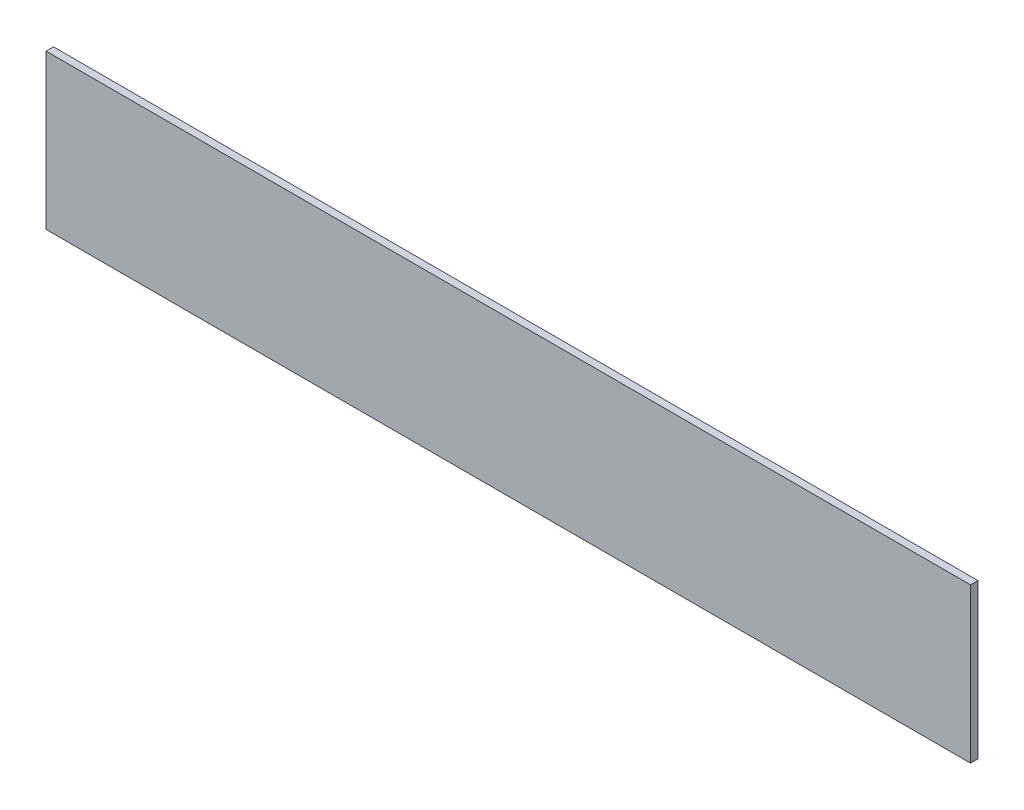
ISO-10303-21;
HEADER;
FILE_DESCRIPTION(('STEP AP214'),'2;1');
FILE_NAME('part.step','',(''),(''),'','','');
FILE_SCHEMA(('AUTOMOTIVE_DESIGN { 1 0 10303 214 1 1 1 1 }'));
ENDSEC;
DATA;
#1=APPLICATION_CONTEXT('core data for automotive mechanical design processes');
#2=APPLICATION_PROTOCOL_DEFINITION('international standard','automotive_design',2000,#1);
#3=PRODUCT_CONTEXT('',#1,'mechanical');
#4=PRODUCT('Part','Part','',(#3));
#5=PRODUCT_RELATED_PRODUCT_CATEGORY('part','',(#4));
#6=PRODUCT_DEFINITION_FORMATION('','',#4);
#7=PRODUCT_DEFINITION_CONTEXT('part definition',#1,'design');
#8=PRODUCT_DEFINITION('design','',#6,#7);
#9=PRODUCT_DEFINITION_SHAPE('','',#8);
#10=(LENGTH_UNIT() NAMED_UNIT(*) SI_UNIT(.MILLI.,.METRE.));
#11=(NAMED_UNIT(*) PLANE_ANGLE_UNIT() SI_UNIT($,.RADIAN.));
#12=(NAMED_UNIT(*) SI_UNIT($,.STERADIAN.) SOLID_ANGLE_UNIT());
#13=UNCERTAINTY_MEASURE_WITH_UNIT(LENGTH_MEASURE(1.E-05),#10,'distance_accuracy_value','');
#14=(GEOMETRIC_REPRESENTATION_CONTEXT(3) GLOBAL_UNCERTAINTY_ASSIGNED_CONTEXT((#13)) GLOBAL_UNIT_ASSIGNED_CONTEXT((#10,
#11,#12)) REPRESENTATION_CONTEXT('',''));
#15=CARTESIAN_POINT('',(0.,0.,0.));
#16=DIRECTION('',(0.,0.,1.));
#17=DIRECTION('',(1.,0.,0.));
#18=AXIS2_PLACEMENT_3D('',#15,#16,#17);
#19=CARTESIAN_POINT('',(0.,0.,3.048));
#20=DIRECTION('',(1.,0.,0.));
#21=DIRECTION('',(0.,0.,-1.));
#22=AXIS2_PLACEMENT_3D('',#19,#20,#21);
#23=PLANE('',#22);
#24=DIRECTION('',(0.,-1.,0.));
#25=VECTOR('',#24,1.);
#26=CARTESIAN_POINT('',(0.,0.,0.));
#27=LINE('',#26,#25);
#28=CARTESIAN_POINT('',(0.,63.5,0.));
#29=VERTEX_POINT('',#28);
#30=CARTESIAN_POINT('',(0.,0.,0.));
#31=VERTEX_POINT('',#30);
#32=EDGE_CURVE('E95',#29,#31,#27,.T.);
#33=ORIENTED_EDGE('',*,*,#32,.T.);
#34=DIRECTION('',(0.,0.,-1.));
#35=VECTOR('',#34,1.);
#36=CARTESIAN_POINT('',(0.,0.,3.048));
#37=LINE('',#36,#35);
#38=CARTESIAN_POINT('',(0.,0.,3.048));
#39=VERTEX_POINT('',#38);
#40=EDGE_CURVE('E11',#39,#31,#37,.T.);
#41=ORIENTED_EDGE('',*,*,#40,.F.);
#42=DIRECTION('',(0.,-1.,0.));
#43=VECTOR('',#42,1.);
#44=CARTESIAN_POINT('',(0.,0.,3.048));
#45=LINE('',#44,#43);
#46=CARTESIAN_POINT('',(0.,63.5,3.048));
#47=VERTEX_POINT('',#46);
#48=EDGE_CURVE('E83',#47,#39,#45,.T.);
#49=ORIENTED_EDGE('',*,*,#48,.F.);
#50=DIRECTION('',(0.,0.,-1.));
#51=VECTOR('',#50,1.);
#52=CARTESIAN_POINT('',(0.,63.5,3.048));
#53=LINE('',#52,#51);
#54=EDGE_CURVE('E91',#47,#29,#53,.T.);
#55=ORIENTED_EDGE('',*,*,#54,.T.);
#56=EDGE_LOOP('',(#33,#41,#49,#55));
#57=FACE_BOUND('',#56,.T.);
#58=ADVANCED_FACE('F32',(#57),#23,.F.);
#59=CARTESIAN_POINT('',(0.,0.,3.048));
#60=DIRECTION('',(0.,1.,0.));
#61=DIRECTION('',(-1.,0.,0.));
#62=AXIS2_PLACEMENT_3D('',#59,#60,#61);
#63=PLANE('',#62);
#64=DIRECTION('',(1.,0.,0.));
#65=VECTOR('',#64,1.);
#66=CARTESIAN_POINT('',(0.,0.,0.));
#67=LINE('',#66,#65);
#68=CARTESIAN_POINT('',(380.1872,0.,0.));
#69=VERTEX_POINT('',#68);
#70=EDGE_CURVE('E87',#31,#69,#67,.T.);
#71=ORIENTED_EDGE('',*,*,#70,.T.);
#72=DIRECTION('',(0.,0.,-1.));
#73=VECTOR('',#72,1.);
#74=CARTESIAN_POINT('',(380.1872,0.,3.048));
#75=LINE('',#74,#73);
#76=CARTESIAN_POINT('',(380.1872,0.,3.048));
#77=VERTEX_POINT('',#76);
#78=EDGE_CURVE('E40',#77,#69,#75,.T.);
#79=ORIENTED_EDGE('',*,*,#78,.F.);
#80=DIRECTION('',(1.,0.,0.));
#81=VECTOR('',#80,1.);
#82=CARTESIAN_POINT('',(0.,0.,3.048));
#83=LINE('',#82,#81);
#84=EDGE_CURVE('E78',#39,#77,#83,.T.);
#85=ORIENTED_EDGE('',*,*,#84,.F.);
#86=ORIENTED_EDGE('',*,*,#40,.T.);
#87=EDGE_LOOP('',(#71,#79,#85,#86));
#88=FACE_BOUND('',#87,.T.);
#89=ADVANCED_FACE('F86',(#88),#63,.F.);
#90=CARTESIAN_POINT('',(380.1872,0.,3.048));
#91=DIRECTION('',(-1.,0.,0.));
#92=DIRECTION('',(0.,0.,1.));
#93=AXIS2_PLACEMENT_3D('',#90,#91,#92);
#94=PLANE('',#93);
#95=DIRECTION('',(0.,1.,0.));
#96=VECTOR('',#95,1.);
#97=CARTESIAN_POINT('',(380.1872,0.,0.));
#98=LINE('',#97,#96);
#99=CARTESIAN_POINT('',(380.1872,63.5,0.));
#100=VERTEX_POINT('',#99);
#101=EDGE_CURVE('E65',#69,#100,#98,.T.);
#102=ORIENTED_EDGE('',*,*,#101,.T.);
#103=DIRECTION('',(0.,0.,-1.));
#104=VECTOR('',#103,1.);
#105=CARTESIAN_POINT('',(380.1872,63.5,3.048));
#106=LINE('',#105,#104);
#107=CARTESIAN_POINT('',(380.1872,63.5,3.048));
#108=VERTEX_POINT('',#107);
#109=EDGE_CURVE('E88',#108,#100,#106,.T.);
#110=ORIENTED_EDGE('',*,*,#109,.F.);
#111=DIRECTION('',(0.,1.,0.));
#112=VECTOR('',#111,1.);
#113=CARTESIAN_POINT('',(380.1872,0.,3.048));
#114=LINE('',#113,#112);
#115=EDGE_CURVE('E81',#77,#108,#114,.T.);
#116=ORIENTED_EDGE('',*,*,#115,.F.);
#117=ORIENTED_EDGE('',*,*,#78,.T.);
#118=EDGE_LOOP('',(#102,#110,#116,#117));
#119=FACE_BOUND('',#118,.T.);
#120=ADVANCED_FACE('F89',(#119),#94,.F.);
#121=CARTESIAN_POINT('',(0.,63.5,3.048));
#122=DIRECTION('',(0.,-1.,0.));
#123=DIRECTION('',(1.,0.,0.));
#124=AXIS2_PLACEMENT_3D('',#121,#122,#123);
#125=PLANE('',#124);
#126=DIRECTION('',(-1.,0.,0.));
#127=VECTOR('',#126,1.);
#128=CARTESIAN_POINT('',(0.,63.5,0.));
#129=LINE('',#128,#127);
#130=EDGE_CURVE('E71',#100,#29,#129,.T.);
#131=ORIENTED_EDGE('',*,*,#130,.T.);
#132=ORIENTED_EDGE('',*,*,#54,.F.);
#133=DIRECTION('',(-1.,0.,0.));
#134=VECTOR('',#133,1.);
#135=CARTESIAN_POINT('',(0.,63.5,3.048));
#136=LINE('',#135,#134);
#137=EDGE_CURVE('E48',#108,#47,#136,.T.);
#138=ORIENTED_EDGE('',*,*,#137,.F.);
#139=ORIENTED_EDGE('',*,*,#109,.T.);
#140=EDGE_LOOP('',(#131,#132,#138,#139));
#141=FACE_BOUND('',#140,.T.);
#142=ADVANCED_FACE('F102',(#141),#125,.F.);
#143=CARTESIAN_POINT('',(0.,0.,3.048));
#144=DIRECTION('',(0.,0.,-1.));
#145=DIRECTION('',(-1.,0.,0.));
#146=AXIS2_PLACEMENT_3D('',#143,#144,#145);
#147=PLANE('',#146);
#148=ORIENTED_EDGE('',*,*,#48,.T.);
#149=ORIENTED_EDGE('',*,*,#84,.T.);
#150=ORIENTED_EDGE('',*,*,#115,.T.);
#151=ORIENTED_EDGE('',*,*,#137,.T.);
#152=EDGE_LOOP('',(#148,#149,#150,#151));
#153=FACE_BOUND('',#152,.T.);
#154=ADVANCED_FACE('F79',(#153),#147,.F.);
#155=CARTESIAN_POINT('',(0.,0.,0.));
#156=DIRECTION('',(0.,0.,-1.));
#157=DIRECTION('',(-1.,0.,0.));
#158=AXIS2_PLACEMENT_3D('',#155,#156,#157);
#159=PLANE('',#158);
#160=ORIENTED_EDGE('',*,*,#32,.F.);
#161=ORIENTED_EDGE('',*,*,#130,.F.);
#162=ORIENTED_EDGE('',*,*,#101,.F.);
#163=ORIENTED_EDGE('',*,*,#70,.F.);
#164=EDGE_LOOP('',(#160,#161,#162,#163));
#165=FACE_BOUND('',#164,.T.);
#166=ADVANCED_FACE('F105',(#165),#159,.T.);
#167=CLOSED_SHELL('',(#58,#89,#120,#142,#154,#166));
#168=MANIFOLD_SOLID_BREP('B2',#167);
#169=ADVANCED_BREP_SHAPE_REPRESENTATION('',(#18,#168),#14);
#170=SHAPE_DEFINITION_REPRESENTATION(#9,#169);
ENDSEC;
END-ISO-10303-21;
